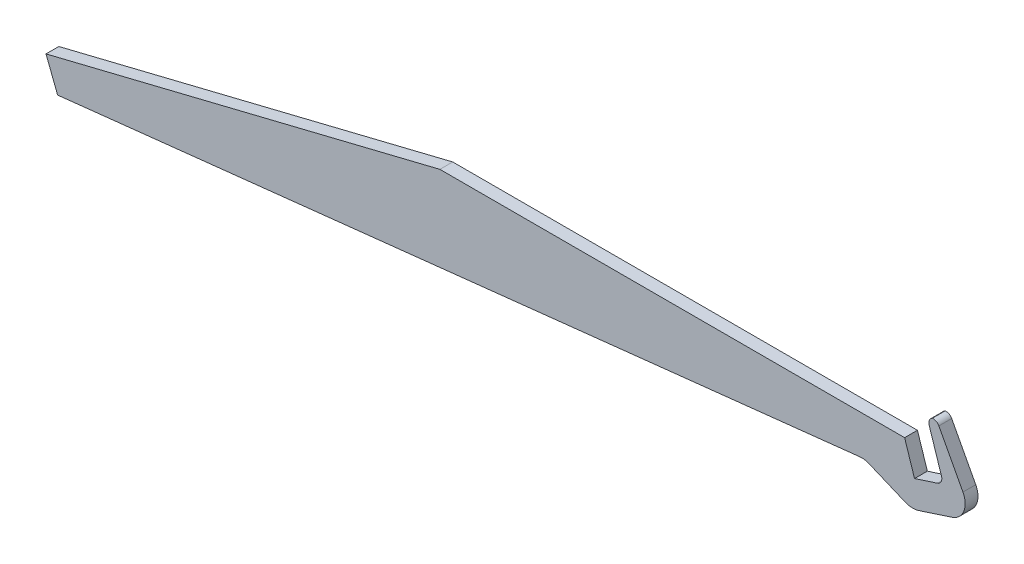
ISO-10303-21;
HEADER;
FILE_DESCRIPTION(('STEP AP214'),'2;1');
FILE_NAME('part.step','',(''),(''),'','','');
FILE_SCHEMA(('AUTOMOTIVE_DESIGN { 1 0 10303 214 1 1 1 1 }'));
ENDSEC;
DATA;
#1=APPLICATION_CONTEXT('core data for automotive mechanical design processes');
#2=APPLICATION_PROTOCOL_DEFINITION('international standard','automotive_design',2000,#1);
#3=PRODUCT_CONTEXT('',#1,'mechanical');
#4=PRODUCT('Part','Part','',(#3));
#5=PRODUCT_RELATED_PRODUCT_CATEGORY('part','',(#4));
#6=PRODUCT_DEFINITION_FORMATION('','',#4);
#7=PRODUCT_DEFINITION_CONTEXT('part definition',#1,'design');
#8=PRODUCT_DEFINITION('design','',#6,#7);
#9=PRODUCT_DEFINITION_SHAPE('','',#8);
#10=(LENGTH_UNIT() NAMED_UNIT(*) SI_UNIT(.MILLI.,.METRE.));
#11=(NAMED_UNIT(*) PLANE_ANGLE_UNIT() SI_UNIT($,.RADIAN.));
#12=(NAMED_UNIT(*) SI_UNIT($,.STERADIAN.) SOLID_ANGLE_UNIT());
#13=UNCERTAINTY_MEASURE_WITH_UNIT(LENGTH_MEASURE(1.E-05),#10,'distance_accuracy_value','');
#14=(GEOMETRIC_REPRESENTATION_CONTEXT(3) GLOBAL_UNCERTAINTY_ASSIGNED_CONTEXT((#13)) GLOBAL_UNIT_ASSIGNED_CONTEXT((#10,
#11,#12)) REPRESENTATION_CONTEXT('',''));
#15=CARTESIAN_POINT('',(0.,0.,0.));
#16=DIRECTION('',(0.,0.,1.));
#17=DIRECTION('',(1.,0.,0.));
#18=AXIS2_PLACEMENT_3D('',#15,#16,#17);
#19=CARTESIAN_POINT('',(-122.911140969515,-30.2550563374355,4.));
#20=DIRECTION('',(0.239019093697016,-0.971014867470245,0.));
#21=DIRECTION('',(0.971014867470245,0.239019093697016,0.));
#22=AXIS2_PLACEMENT_3D('',#19,#20,#21);
#23=PLANE('',#22);
#24=DIRECTION('',(-0.971014867470245,-0.239019093697016,0.));
#25=VECTOR('',#24,1.);
#26=CARTESIAN_POINT('',(-122.911140969515,-30.2550563374355,0.));
#27=LINE('',#26,#25);
#28=CARTESIAN_POINT('',(0.,0.,0.));
#29=VERTEX_POINT('',#28);
#30=CARTESIAN_POINT('',(-122.911140969515,-30.2550563374355,0.));
#31=VERTEX_POINT('',#30);
#32=EDGE_CURVE('E185',#29,#31,#27,.T.);
#33=ORIENTED_EDGE('',*,*,#32,.T.);
#34=DIRECTION('',(0.,0.,-1.));
#35=VECTOR('',#34,1.);
#36=CARTESIAN_POINT('',(-122.911140969515,-30.2550563374355,4.));
#37=LINE('',#36,#35);
#38=CARTESIAN_POINT('',(-122.911140969515,-30.2550563374355,4.));
#39=VERTEX_POINT('',#38);
#40=EDGE_CURVE('E163',#39,#31,#37,.T.);
#41=ORIENTED_EDGE('',*,*,#40,.F.);
#42=DIRECTION('',(-0.971014867470245,-0.239019093697016,0.));
#43=VECTOR('',#42,1.);
#44=CARTESIAN_POINT('',(-122.911140969515,-30.2550563374355,4.));
#45=LINE('',#44,#43);
#46=CARTESIAN_POINT('',(0.,0.,4.));
#47=VERTEX_POINT('',#46);
#48=EDGE_CURVE('E171',#47,#39,#45,.T.);
#49=ORIENTED_EDGE('',*,*,#48,.F.);
#50=DIRECTION('',(0.,0.,-1.));
#51=VECTOR('',#50,1.);
#52=CARTESIAN_POINT('',(0.,0.,4.));
#53=LINE('',#52,#51);
#54=EDGE_CURVE('E308',#47,#29,#53,.T.);
#55=ORIENTED_EDGE('',*,*,#54,.T.);
#56=EDGE_LOOP('',(#33,#41,#49,#55));
#57=FACE_BOUND('',#56,.T.);
#58=ADVANCED_FACE('F43',(#57),#23,.F.);
#59=CARTESIAN_POINT('',(-119.286760586678,-39.5751350302636,4.));
#60=DIRECTION('',(0.932007869282802,0.362438038283694,0.));
#61=DIRECTION('',(-0.362438038283694,0.932007869282802,0.));
#62=AXIS2_PLACEMENT_3D('',#59,#60,#61);
#63=PLANE('',#62);
#64=DIRECTION('',(0.362438038283694,-0.932007869282802,0.));
#65=VECTOR('',#64,1.);
#66=CARTESIAN_POINT('',(-119.286760586678,-39.5751350302636,0.));
#67=LINE('',#66,#65);
#68=CARTESIAN_POINT('',(-119.286760586678,-39.5751350302636,0.));
#69=VERTEX_POINT('',#68);
#70=EDGE_CURVE('E275',#31,#69,#67,.T.);
#71=ORIENTED_EDGE('',*,*,#70,.T.);
#72=DIRECTION('',(0.,0.,-1.));
#73=VECTOR('',#72,1.);
#74=CARTESIAN_POINT('',(-119.286760586678,-39.5751350302636,4.));
#75=LINE('',#74,#73);
#76=CARTESIAN_POINT('',(-119.286760586678,-39.5751350302636,4.));
#77=VERTEX_POINT('',#76);
#78=EDGE_CURVE('E166',#77,#69,#75,.T.);
#79=ORIENTED_EDGE('',*,*,#78,.F.);
#80=DIRECTION('',(0.362438038283694,-0.932007869282802,0.));
#81=VECTOR('',#80,1.);
#82=CARTESIAN_POINT('',(-119.286760586678,-39.5751350302636,4.));
#83=LINE('',#82,#81);
#84=EDGE_CURVE('E158',#39,#77,#83,.T.);
#85=ORIENTED_EDGE('',*,*,#84,.F.);
#86=ORIENTED_EDGE('',*,*,#40,.T.);
#87=EDGE_LOOP('',(#71,#79,#85,#86));
#88=FACE_BOUND('',#87,.T.);
#89=ADVANCED_FACE('F161',(#88),#63,.F.);
#90=CARTESIAN_POINT('',(132.5,-12.,4.));
#91=DIRECTION('',(-0.108866874851958,0.99405633822232,0.));
#92=DIRECTION('',(-0.99405633822232,-0.108866874851958,0.));
#93=AXIS2_PLACEMENT_3D('',#90,#91,#92);
#94=PLANE('',#93);
#95=DIRECTION('',(0.99405633822232,0.108866874851958,0.));
#96=VECTOR('',#95,1.);
#97=CARTESIAN_POINT('',(132.5,-12.,0.));
#98=LINE('',#97,#96);
#99=CARTESIAN_POINT('',(130.955973932504,-12.169098356094,0.));
#100=VERTEX_POINT('',#99);
#101=EDGE_CURVE('E266',#69,#100,#98,.T.);
#102=ORIENTED_EDGE('',*,*,#101,.T.);
#103=DIRECTION('',(0.,0.,-1.));
#104=VECTOR('',#103,1.);
#105=CARTESIAN_POINT('',(130.955973932504,-12.169098356094,4.));
#106=LINE('',#105,#104);
#107=CARTESIAN_POINT('',(130.955973932504,-12.169098356094,4.));
#108=VERTEX_POINT('',#107);
#109=EDGE_CURVE('E238',#100,#108,#106,.F.);
#110=ORIENTED_EDGE('',*,*,#109,.T.);
#111=DIRECTION('',(0.99405633822232,0.108866874851958,0.));
#112=VECTOR('',#111,1.);
#113=CARTESIAN_POINT('',(0.,-26.5111100480286,4.));
#114=LINE('',#113,#112);
#115=EDGE_CURVE('E170',#77,#108,#114,.T.);
#116=ORIENTED_EDGE('',*,*,#115,.F.);
#117=ORIENTED_EDGE('',*,*,#78,.T.);
#118=EDGE_LOOP('',(#102,#110,#116,#117));
#119=FACE_BOUND('',#118,.T.);
#120=ADVANCED_FACE('F273',(#119),#94,.F.);
#121=CARTESIAN_POINT('',(147.252212566753,-18.1945318132475,4.));
#122=DIRECTION('',(0.387158238327969,0.922013285422062,0.));
#123=DIRECTION('',(-0.922013285422062,0.387158238327969,0.));
#124=AXIS2_PLACEMENT_3D('',#121,#122,#123);
#125=PLANE('',#124);
#126=DIRECTION('',(0.922013285422061,-0.387158238327969,0.));
#127=VECTOR('',#126,1.);
#128=CARTESIAN_POINT('',(147.252212566753,-18.1945318132475,4.));
#129=LINE('',#128,#127);
#130=CARTESIAN_POINT('',(133.932124611584,-12.6013566728956,4.));
#131=VERTEX_POINT('',#130);
#132=CARTESIAN_POINT('',(145.196070890841,-17.3311470859499,4.));
#133=VERTEX_POINT('',#132);
#134=EDGE_CURVE('E280',#131,#133,#129,.T.);
#135=ORIENTED_EDGE('',*,*,#134,.F.);
#136=DIRECTION('',(0.,0.,-1.));
#137=VECTOR('',#136,1.);
#138=CARTESIAN_POINT('',(133.932124611584,-12.6013566728956,0.));
#139=LINE('',#138,#137);
#140=CARTESIAN_POINT('',(133.932124611584,-12.6013566728956,0.));
#141=VERTEX_POINT('',#140);
#142=EDGE_CURVE('E234',#131,#141,#139,.T.);
#143=ORIENTED_EDGE('',*,*,#142,.T.);
#144=DIRECTION('',(0.922013285422061,-0.387158238327969,0.));
#145=VECTOR('',#144,1.);
#146=CARTESIAN_POINT('',(147.252212566753,-18.1945318132475,0.));
#147=LINE('',#146,#145);
#148=CARTESIAN_POINT('',(145.196070890841,-17.3311470859499,0.));
#149=VERTEX_POINT('',#148);
#150=EDGE_CURVE('E268',#141,#149,#147,.T.);
#151=ORIENTED_EDGE('',*,*,#150,.T.);
#152=DIRECTION('',(0.,0.,-1.));
#153=VECTOR('',#152,1.);
#154=CARTESIAN_POINT('',(145.196070890841,-17.3311470859499,4.));
#155=LINE('',#154,#153);
#156=EDGE_CURVE('E227',#149,#133,#155,.F.);
#157=ORIENTED_EDGE('',*,*,#156,.T.);
#158=EDGE_LOOP('',(#135,#143,#151,#157));
#159=FACE_BOUND('',#158,.T.);
#160=ADVANCED_FACE('F283',(#159),#125,.F.);
#161=CARTESIAN_POINT('',(166.551226371477,-11.9239021102219,4.));
#162=DIRECTION('',(-0.309016994374945,0.951056516295154,0.));
#163=DIRECTION('',(-0.951056516295154,-0.309016994374945,0.));
#164=AXIS2_PLACEMENT_3D('',#161,#162,#163);
#165=PLANE('',#164);
#166=DIRECTION('',(0.951056516295154,0.309016994374945,0.));
#167=VECTOR('',#166,1.);
#168=CARTESIAN_POINT('',(166.551226371477,-11.9239021102219,4.));
#169=LINE('',#168,#167);
#170=CARTESIAN_POINT('',(149.373122287058,-17.5054064711885,4.));
#171=VERTEX_POINT('',#170);
#172=CARTESIAN_POINT('',(159.750676251148,-14.133534789536,4.));
#173=VERTEX_POINT('',#172);
#174=EDGE_CURVE('E286',#171,#173,#169,.T.);
#175=ORIENTED_EDGE('',*,*,#174,.F.);
#176=DIRECTION('',(0.,0.,-1.));
#177=VECTOR('',#176,1.);
#178=CARTESIAN_POINT('',(149.373122287058,-17.5054064711885,4.));
#179=LINE('',#178,#177);
#180=CARTESIAN_POINT('',(149.373122287058,-17.5054064711885,0.));
#181=VERTEX_POINT('',#180);
#182=EDGE_CURVE('E244',#171,#181,#179,.T.);
#183=ORIENTED_EDGE('',*,*,#182,.T.);
#184=DIRECTION('',(0.951056516295154,0.309016994374945,0.));
#185=VECTOR('',#184,1.);
#186=CARTESIAN_POINT('',(166.551226371477,-11.9239021102219,0.));
#187=LINE('',#186,#185);
#188=CARTESIAN_POINT('',(159.750676251148,-14.133534789536,0.));
#189=VERTEX_POINT('',#188);
#190=EDGE_CURVE('E315',#181,#189,#187,.T.);
#191=ORIENTED_EDGE('',*,*,#190,.T.);
#192=DIRECTION('',(0.,0.,-1.));
#193=VECTOR('',#192,1.);
#194=CARTESIAN_POINT('',(159.750676251148,-14.133534789536,4.));
#195=LINE('',#194,#193);
#196=EDGE_CURVE('E241',#189,#173,#195,.F.);
#197=ORIENTED_EDGE('',*,*,#196,.T.);
#198=EDGE_LOOP('',(#175,#183,#191,#197));
#199=FACE_BOUND('',#198,.T.);
#200=ADVANCED_FACE('F393',(#199),#165,.F.);
#201=CARTESIAN_POINT('',(154.894080840649,10.,4.));
#202=DIRECTION('',(-0.882947592858932,-0.469471562785882,0.));
#203=DIRECTION('',(0.469471562785882,-0.882947592858932,0.));
#204=AXIS2_PLACEMENT_3D('',#201,#202,#203);
#205=PLANE('',#204);
#206=DIRECTION('',(-0.469471562785882,0.882947592858932,0.));
#207=VECTOR('',#206,1.);
#208=CARTESIAN_POINT('',(154.894080840649,10.,4.));
#209=LINE('',#208,#207);
#210=CARTESIAN_POINT('',(163.194259842052,-5.61036631504974,4.));
#211=VERTEX_POINT('',#210);
#212=CARTESIAN_POINT('',(155.681947671013,8.51823800096639,4.));
#213=VERTEX_POINT('',#212);
#214=EDGE_CURVE('E290',#211,#213,#209,.T.);
#215=ORIENTED_EDGE('',*,*,#214,.F.);
#216=DIRECTION('',(0.,0.,-1.));
#217=VECTOR('',#216,1.);
#218=CARTESIAN_POINT('',(163.194259842052,-5.61036631504975,4.));
#219=LINE('',#218,#217);
#220=CARTESIAN_POINT('',(163.194259842052,-5.61036631504974,0.));
#221=VERTEX_POINT('',#220);
#222=EDGE_CURVE('E258',#211,#221,#219,.T.);
#223=ORIENTED_EDGE('',*,*,#222,.T.);
#224=DIRECTION('',(-0.469471562785882,0.882947592858932,0.));
#225=VECTOR('',#224,1.);
#226=CARTESIAN_POINT('',(154.894080840649,10.,0.));
#227=LINE('',#226,#225);
#228=CARTESIAN_POINT('',(155.681947671013,8.51823800096639,0.));
#229=VERTEX_POINT('',#228);
#230=EDGE_CURVE('E319',#221,#229,#227,.T.);
#231=ORIENTED_EDGE('',*,*,#230,.T.);
#232=DIRECTION('',(0.,0.,-1.));
#233=VECTOR('',#232,1.);
#234=CARTESIAN_POINT('',(155.681947671013,8.51823800096639,4.));
#235=LINE('',#234,#233);
#236=EDGE_CURVE('E217',#229,#213,#235,.F.);
#237=ORIENTED_EDGE('',*,*,#236,.T.);
#238=EDGE_LOOP('',(#215,#223,#231,#237));
#239=FACE_BOUND('',#238,.T.);
#240=ADVANCED_FACE('F396',(#239),#205,.F.);
#241=CARTESIAN_POINT('',(157.125206848553,-6.57490371638956,4.));
#242=DIRECTION('',(0.951056516295155,0.309016994374945,0.));
#243=DIRECTION('',(-0.309016994374945,0.951056516295155,0.));
#244=AXIS2_PLACEMENT_3D('',#241,#242,#243);
#245=PLANE('',#244);
#246=DIRECTION('',(0.309016994374944,-0.951056516295155,0.));
#247=VECTOR('',#246,1.);
#248=CARTESIAN_POINT('',(157.125206848553,-6.57490371638956,0.));
#249=LINE('',#248,#247);
#250=CARTESIAN_POINT('',(152.658945280514,7.17083598428486,0.));
#251=VERTEX_POINT('',#250);
#252=CARTESIAN_POINT('',(156.507172859804,-4.67279068379927,0.));
#253=VERTEX_POINT('',#252);
#254=EDGE_CURVE('E322',#251,#253,#249,.T.);
#255=ORIENTED_EDGE('',*,*,#254,.T.);
#256=DIRECTION('',(0.,0.,-1.));
#257=VECTOR('',#256,1.);
#258=CARTESIAN_POINT('',(156.507172859804,-4.67279068379927,4.));
#259=LINE('',#258,#257);
#260=CARTESIAN_POINT('',(156.507172859804,-4.67279068379927,4.));
#261=VERTEX_POINT('',#260);
#262=EDGE_CURVE('E201',#253,#261,#259,.F.);
#263=ORIENTED_EDGE('',*,*,#262,.T.);
#264=DIRECTION('',(0.309016994374944,-0.951056516295155,0.));
#265=VECTOR('',#264,1.);
#266=CARTESIAN_POINT('',(157.125206848553,-6.57490371638956,4.));
#267=LINE('',#266,#265);
#268=CARTESIAN_POINT('',(152.658945280514,7.17083598428486,4.));
#269=VERTEX_POINT('',#268);
#270=EDGE_CURVE('E296',#269,#261,#267,.T.);
#271=ORIENTED_EDGE('',*,*,#270,.F.);
#272=DIRECTION('',(0.,0.,-1.));
#273=VECTOR('',#272,1.);
#274=CARTESIAN_POINT('',(152.658945280514,7.17083598428486,4.));
#275=LINE('',#274,#273);
#276=EDGE_CURVE('E192',#269,#251,#275,.T.);
#277=ORIENTED_EDGE('',*,*,#276,.T.);
#278=EDGE_LOOP('',(#255,#263,#271,#277));
#279=FACE_BOUND('',#278,.T.);
#280=ADVANCED_FACE('F407',(#279),#245,.F.);
#281=CARTESIAN_POINT('',(148.090169943749,-9.51056516295154,4.));
#282=DIRECTION('',(0.309016994374945,-0.951056516295154,0.));
#283=DIRECTION('',(0.951056516295155,0.309016994374945,0.));
#284=AXIS2_PLACEMENT_3D('',#281,#282,#283);
#285=PLANE('',#284);
#286=DIRECTION('',(-0.951056516295154,-0.309016994374945,0.));
#287=VECTOR('',#286,1.);
#288=CARTESIAN_POINT('',(148.090169943749,-9.51056516295154,4.));
#289=LINE('',#288,#287);
#290=CARTESIAN_POINT('',(155.223093815963,-7.19293770513945,4.));
#291=VERTEX_POINT('',#290);
#292=CARTESIAN_POINT('',(148.090169943749,-9.51056516295154,4.));
#293=VERTEX_POINT('',#292);
#294=EDGE_CURVE('E300',#291,#293,#289,.T.);
#295=ORIENTED_EDGE('',*,*,#294,.F.);
#296=DIRECTION('',(0.,0.,-1.));
#297=VECTOR('',#296,1.);
#298=CARTESIAN_POINT('',(155.223093815963,-7.19293770513945,0.));
#299=LINE('',#298,#297);
#300=CARTESIAN_POINT('',(155.223093815963,-7.19293770513945,0.));
#301=VERTEX_POINT('',#300);
#302=EDGE_CURVE('E187',#291,#301,#299,.T.);
#303=ORIENTED_EDGE('',*,*,#302,.T.);
#304=DIRECTION('',(-0.951056516295154,-0.309016994374945,0.));
#305=VECTOR('',#304,1.);
#306=CARTESIAN_POINT('',(148.090169943749,-9.51056516295154,0.));
#307=LINE('',#306,#305);
#308=CARTESIAN_POINT('',(148.090169943749,-9.51056516295154,0.));
#309=VERTEX_POINT('',#308);
#310=EDGE_CURVE('E326',#301,#309,#307,.T.);
#311=ORIENTED_EDGE('',*,*,#310,.T.);
#312=DIRECTION('',(0.,0.,-1.));
#313=VECTOR('',#312,1.);
#314=CARTESIAN_POINT('',(148.090169943749,-9.51056516295154,4.));
#315=LINE('',#314,#313);
#316=EDGE_CURVE('E194',#293,#309,#315,.T.);
#317=ORIENTED_EDGE('',*,*,#316,.F.);
#318=EDGE_LOOP('',(#295,#303,#311,#317));
#319=FACE_BOUND('',#318,.T.);
#320=ADVANCED_FACE('F360',(#319),#285,.F.);
#321=CARTESIAN_POINT('',(145.,0.,4.));
#322=DIRECTION('',(-0.951056516295155,-0.309016994374945,0.));
#323=DIRECTION('',(0.309016994374945,-0.951056516295155,0.));
#324=AXIS2_PLACEMENT_3D('',#321,#322,#323);
#325=PLANE('',#324);
#326=DIRECTION('',(-0.309016994374944,0.951056516295155,0.));
#327=VECTOR('',#326,1.);
#328=CARTESIAN_POINT('',(145.,0.,0.));
#329=LINE('',#328,#327);
#330=CARTESIAN_POINT('',(145.,0.,0.));
#331=VERTEX_POINT('',#330);
#332=EDGE_CURVE('E329',#309,#331,#329,.T.);
#333=ORIENTED_EDGE('',*,*,#332,.T.);
#334=DIRECTION('',(0.,0.,-1.));
#335=VECTOR('',#334,1.);
#336=CARTESIAN_POINT('',(145.,0.,4.));
#337=LINE('',#336,#335);
#338=CARTESIAN_POINT('',(145.,0.,4.));
#339=VERTEX_POINT('',#338);
#340=EDGE_CURVE('E336',#339,#331,#337,.T.);
#341=ORIENTED_EDGE('',*,*,#340,.F.);
#342=DIRECTION('',(-0.309016994374944,0.951056516295155,0.));
#343=VECTOR('',#342,1.);
#344=CARTESIAN_POINT('',(145.,0.,4.));
#345=LINE('',#344,#343);
#346=EDGE_CURVE('E303',#293,#339,#345,.T.);
#347=ORIENTED_EDGE('',*,*,#346,.F.);
#348=ORIENTED_EDGE('',*,*,#316,.T.);
#349=EDGE_LOOP('',(#333,#341,#347,#348));
#350=FACE_BOUND('',#349,.T.);
#351=ADVANCED_FACE('F345',(#350),#325,.F.);
#352=CARTESIAN_POINT('',(0.,0.,4.));
#353=DIRECTION('',(0.,-1.,0.));
#354=DIRECTION('',(0.,0.,-1.));
#355=AXIS2_PLACEMENT_3D('',#352,#353,#354);
#356=PLANE('',#355);
#357=DIRECTION('',(-1.,0.,0.));
#358=VECTOR('',#357,1.);
#359=CARTESIAN_POINT('',(0.,0.,0.));
#360=LINE('',#359,#358);
#361=EDGE_CURVE('E182',#331,#29,#360,.T.);
#362=ORIENTED_EDGE('',*,*,#361,.T.);
#363=ORIENTED_EDGE('',*,*,#54,.F.);
#364=DIRECTION('',(-1.,0.,0.));
#365=VECTOR('',#364,1.);
#366=CARTESIAN_POINT('',(0.,0.,4.));
#367=LINE('',#366,#365);
#368=EDGE_CURVE('E177',#339,#47,#367,.T.);
#369=ORIENTED_EDGE('',*,*,#368,.F.);
#370=ORIENTED_EDGE('',*,*,#340,.T.);
#371=EDGE_LOOP('',(#362,#363,#369,#370));
#372=FACE_BOUND('',#371,.T.);
#373=ADVANCED_FACE('F352',(#372),#356,.F.);
#374=CARTESIAN_POINT('',(0.,0.,4.));
#375=DIRECTION('',(0.,0.,-1.));
#376=DIRECTION('',(-1.,0.,0.));
#377=AXIS2_PLACEMENT_3D('',#374,#375,#376);
#378=PLANE('',#377);
#379=ORIENTED_EDGE('',*,*,#134,.T.);
#380=CARTESIAN_POINT('',(147.519020320809,-11.7990673734176,4.));
#381=DIRECTION('',(0.,0.,-1.));
#382=DIRECTION('',(-1.,0.,0.));
#383=AXIS2_PLACEMENT_3D('',#380,#381,#382);
#384=CIRCLE('',#383,6.);
#385=EDGE_CURVE('E255',#133,#171,#384,.F.);
#386=ORIENTED_EDGE('',*,*,#385,.T.);
#387=ORIENTED_EDGE('',*,*,#174,.T.);
#388=CARTESIAN_POINT('',(157.896574284898,-8.42719569176503,4.));
#389=DIRECTION('',(0.,0.,-1.));
#390=DIRECTION('',(-1.,0.,0.));
#391=AXIS2_PLACEMENT_3D('',#388,#389,#390);
#392=CIRCLE('',#391,6.);
#393=EDGE_CURVE('E59',#173,#211,#392,.F.);
#394=ORIENTED_EDGE('',*,*,#393,.T.);
#395=ORIENTED_EDGE('',*,*,#214,.T.);
#396=CARTESIAN_POINT('',(153.916052485295,7.57929487539462,4.));
#397=DIRECTION('',(0.,0.,-1.));
#398=DIRECTION('',(-1.,0.,0.));
#399=AXIS2_PLACEMENT_3D('',#396,#397,#398);
#400=CIRCLE('',#399,2.);
#401=CARTESIAN_POINT('',(153.629469542475,9.55865593818339,4.));
#402=VERTEX_POINT('',#401);
#403=EDGE_CURVE('E211',#213,#402,#400,.F.);
#404=ORIENTED_EDGE('',*,*,#403,.T.);
#405=CARTESIAN_POINT('',(154.561058313104,7.78886997303474,4.));
#406=DIRECTION('',(0.,0.,-1.));
#407=DIRECTION('',(-1.,0.,0.));
#408=AXIS2_PLACEMENT_3D('',#405,#406,#407);
#409=CIRCLE('',#408,2.);
#410=EDGE_CURVE('E214',#402,#269,#409,.F.);
#411=ORIENTED_EDGE('',*,*,#410,.T.);
#412=ORIENTED_EDGE('',*,*,#270,.T.);
#413=CARTESIAN_POINT('',(154.605059827213,-5.29082467254915,4.));
#414=DIRECTION('',(0.,0.,-1.));
#415=DIRECTION('',(-1.,0.,0.));
#416=AXIS2_PLACEMENT_3D('',#413,#414,#415);
#417=CIRCLE('',#416,2.);
#418=EDGE_CURVE('E224',#261,#291,#417,.T.);
#419=ORIENTED_EDGE('',*,*,#418,.T.);
#420=ORIENTED_EDGE('',*,*,#294,.T.);
#421=ORIENTED_EDGE('',*,*,#346,.T.);
#422=ORIENTED_EDGE('',*,*,#368,.T.);
#423=ORIENTED_EDGE('',*,*,#48,.T.);
#424=ORIENTED_EDGE('',*,*,#84,.T.);
#425=ORIENTED_EDGE('',*,*,#115,.T.);
#426=CARTESIAN_POINT('',(131.609175181616,-18.1334363854279,4.));
#427=DIRECTION('',(0.,0.,-1.));
#428=DIRECTION('',(-1.,0.,0.));
#429=AXIS2_PLACEMENT_3D('',#426,#427,#428);
#430=CIRCLE('',#429,6.);
#431=EDGE_CURVE('E11',#108,#131,#430,.T.);
#432=ORIENTED_EDGE('',*,*,#431,.T.);
#433=EDGE_LOOP('',(#379,#386,#387,#394,#395,#404,#411,#412,#419,#420,#421,#422,#423,#424,#425,#432));
#434=FACE_BOUND('',#433,.T.);
#435=ADVANCED_FACE('F175',(#434),#378,.F.);
#436=CARTESIAN_POINT('',(0.,0.,0.));
#437=DIRECTION('',(0.,0.,-1.));
#438=DIRECTION('',(-1.,0.,0.));
#439=AXIS2_PLACEMENT_3D('',#436,#437,#438);
#440=PLANE('',#439);
#441=ORIENTED_EDGE('',*,*,#190,.F.);
#442=CARTESIAN_POINT('',(147.519020320809,-11.7990673734176,0.));
#443=DIRECTION('',(0.,0.,-1.));
#444=DIRECTION('',(-1.,0.,0.));
#445=AXIS2_PLACEMENT_3D('',#442,#443,#444);
#446=CIRCLE('',#445,6.);
#447=EDGE_CURVE('E250',#181,#149,#446,.T.);
#448=ORIENTED_EDGE('',*,*,#447,.T.);
#449=ORIENTED_EDGE('',*,*,#150,.F.);
#450=CARTESIAN_POINT('',(131.609175181616,-18.1334363854279,0.));
#451=DIRECTION('',(0.,0.,-1.));
#452=DIRECTION('',(-1.,0.,0.));
#453=AXIS2_PLACEMENT_3D('',#450,#451,#452);
#454=CIRCLE('',#453,6.);
#455=EDGE_CURVE('E52',#141,#100,#454,.F.);
#456=ORIENTED_EDGE('',*,*,#455,.T.);
#457=ORIENTED_EDGE('',*,*,#101,.F.);
#458=ORIENTED_EDGE('',*,*,#70,.F.);
#459=ORIENTED_EDGE('',*,*,#32,.F.);
#460=ORIENTED_EDGE('',*,*,#361,.F.);
#461=ORIENTED_EDGE('',*,*,#332,.F.);
#462=ORIENTED_EDGE('',*,*,#310,.F.);
#463=CARTESIAN_POINT('',(154.605059827213,-5.29082467254915,0.));
#464=DIRECTION('',(0.,0.,-1.));
#465=DIRECTION('',(-1.,0.,0.));
#466=AXIS2_PLACEMENT_3D('',#463,#464,#465);
#467=CIRCLE('',#466,2.);
#468=EDGE_CURVE('E221',#301,#253,#467,.F.);
#469=ORIENTED_EDGE('',*,*,#468,.T.);
#470=ORIENTED_EDGE('',*,*,#254,.F.);
#471=CARTESIAN_POINT('',(154.561058313104,7.78886997303474,0.));
#472=DIRECTION('',(0.,0.,-1.));
#473=DIRECTION('',(-1.,0.,0.));
#474=AXIS2_PLACEMENT_3D('',#471,#472,#473);
#475=CIRCLE('',#474,2.);
#476=CARTESIAN_POINT('',(153.629469542475,9.55865593818339,0.));
#477=VERTEX_POINT('',#476);
#478=EDGE_CURVE('E208',#251,#477,#475,.T.);
#479=ORIENTED_EDGE('',*,*,#478,.T.);
#480=CARTESIAN_POINT('',(153.916052485295,7.57929487539462,0.));
#481=DIRECTION('',(0.,0.,-1.));
#482=DIRECTION('',(-1.,0.,0.));
#483=AXIS2_PLACEMENT_3D('',#480,#481,#482);
#484=CIRCLE('',#483,2.);
#485=EDGE_CURVE('E204',#477,#229,#484,.T.);
#486=ORIENTED_EDGE('',*,*,#485,.T.);
#487=ORIENTED_EDGE('',*,*,#230,.F.);
#488=CARTESIAN_POINT('',(157.896574284898,-8.42719569176503,0.));
#489=DIRECTION('',(0.,0.,-1.));
#490=DIRECTION('',(-1.,0.,0.));
#491=AXIS2_PLACEMENT_3D('',#488,#489,#490);
#492=CIRCLE('',#491,6.);
#493=EDGE_CURVE('E67',#221,#189,#492,.T.);
#494=ORIENTED_EDGE('',*,*,#493,.T.);
#495=EDGE_LOOP('',(#441,#448,#449,#456,#457,#458,#459,#460,#461,#462,#469,#470,#479,#486,#487,#494));
#496=FACE_BOUND('',#495,.T.);
#497=ADVANCED_FACE('F265',(#496),#440,.T.);
#498=CARTESIAN_POINT('',(154.605059827213,-5.29082467254915,4.));
#499=DIRECTION('',(0.,0.,1.));
#500=DIRECTION('',(1.,0.,0.));
#501=AXIS2_PLACEMENT_3D('',#498,#499,#500);
#502=CYLINDRICAL_SURFACE('',#501,2.);
#503=ORIENTED_EDGE('',*,*,#418,.F.);
#504=ORIENTED_EDGE('',*,*,#262,.F.);
#505=ORIENTED_EDGE('',*,*,#468,.F.);
#506=ORIENTED_EDGE('',*,*,#302,.F.);
#507=EDGE_LOOP('',(#503,#504,#505,#506));
#508=FACE_BOUND('',#507,.T.);
#509=ADVANCED_FACE('F371',(#508),#502,.F.);
#510=CARTESIAN_POINT('',(153.916052485295,7.57929487539462,4.));
#511=DIRECTION('',(0.,0.,-1.));
#512=DIRECTION('',(-1.,0.,0.));
#513=AXIS2_PLACEMENT_3D('',#510,#511,#512);
#514=CYLINDRICAL_SURFACE('',#513,2.);
#515=DIRECTION('',(0.,0.,-1.));
#516=VECTOR('',#515,1.);
#517=CARTESIAN_POINT('',(153.629469542475,9.5586559381834,2.));
#518=LINE('',#517,#516);
#519=EDGE_CURVE('E228',#402,#477,#518,.T.);
#520=ORIENTED_EDGE('',*,*,#519,.F.);
#521=ORIENTED_EDGE('',*,*,#403,.F.);
#522=ORIENTED_EDGE('',*,*,#236,.F.);
#523=ORIENTED_EDGE('',*,*,#485,.F.);
#524=EDGE_LOOP('',(#520,#521,#522,#523));
#525=FACE_BOUND('',#524,.T.);
#526=ADVANCED_FACE('F374',(#525),#514,.T.);
#527=CARTESIAN_POINT('',(154.561058313104,7.78886997303474,4.));
#528=DIRECTION('',(0.,0.,-1.));
#529=DIRECTION('',(-1.,0.,0.));
#530=AXIS2_PLACEMENT_3D('',#527,#528,#529);
#531=CYLINDRICAL_SURFACE('',#530,2.);
#532=ORIENTED_EDGE('',*,*,#410,.F.);
#533=ORIENTED_EDGE('',*,*,#519,.T.);
#534=ORIENTED_EDGE('',*,*,#478,.F.);
#535=ORIENTED_EDGE('',*,*,#276,.F.);
#536=EDGE_LOOP('',(#532,#533,#534,#535));
#537=FACE_BOUND('',#536,.T.);
#538=ADVANCED_FACE('F376',(#537),#531,.T.);
#539=CARTESIAN_POINT('',(131.609175181616,-18.1334363854279,4.));
#540=DIRECTION('',(0.,0.,1.));
#541=DIRECTION('',(1.,0.,0.));
#542=AXIS2_PLACEMENT_3D('',#539,#540,#541);
#543=CYLINDRICAL_SURFACE('',#542,6.);
#544=ORIENTED_EDGE('',*,*,#431,.F.);
#545=ORIENTED_EDGE('',*,*,#109,.F.);
#546=ORIENTED_EDGE('',*,*,#455,.F.);
#547=ORIENTED_EDGE('',*,*,#142,.F.);
#548=EDGE_LOOP('',(#544,#545,#546,#547));
#549=FACE_BOUND('',#548,.T.);
#550=ADVANCED_FACE('F278',(#549),#543,.F.);
#551=CARTESIAN_POINT('',(147.519020320809,-11.7990673734176,4.));
#552=DIRECTION('',(0.,0.,-1.));
#553=DIRECTION('',(-1.,0.,0.));
#554=AXIS2_PLACEMENT_3D('',#551,#552,#553);
#555=CYLINDRICAL_SURFACE('',#554,6.);
#556=ORIENTED_EDGE('',*,*,#385,.F.);
#557=ORIENTED_EDGE('',*,*,#156,.F.);
#558=ORIENTED_EDGE('',*,*,#447,.F.);
#559=ORIENTED_EDGE('',*,*,#182,.F.);
#560=EDGE_LOOP('',(#556,#557,#558,#559));
#561=FACE_BOUND('',#560,.T.);
#562=ADVANCED_FACE('F384',(#561),#555,.T.);
#563=CARTESIAN_POINT('',(157.896574284898,-8.42719569176503,4.));
#564=DIRECTION('',(0.,0.,-1.));
#565=DIRECTION('',(-1.,0.,0.));
#566=AXIS2_PLACEMENT_3D('',#563,#564,#565);
#567=CYLINDRICAL_SURFACE('',#566,6.);
#568=ORIENTED_EDGE('',*,*,#393,.F.);
#569=ORIENTED_EDGE('',*,*,#196,.F.);
#570=ORIENTED_EDGE('',*,*,#493,.F.);
#571=ORIENTED_EDGE('',*,*,#222,.F.);
#572=EDGE_LOOP('',(#568,#569,#570,#571));
#573=FACE_BOUND('',#572,.T.);
#574=ADVANCED_FACE('F45',(#573),#567,.T.);
#575=CLOSED_SHELL('',(#58,#89,#120,#160,#200,#240,#280,#320,#351,#373,#435,#497,#509,#526,#538,
#550,#562,#574));
#576=MANIFOLD_SOLID_BREP('B2',#575);
#577=ADVANCED_BREP_SHAPE_REPRESENTATION('',(#18,#576),#14);
#578=SHAPE_DEFINITION_REPRESENTATION(#9,#577);
ENDSEC;
END-ISO-10303-21;
